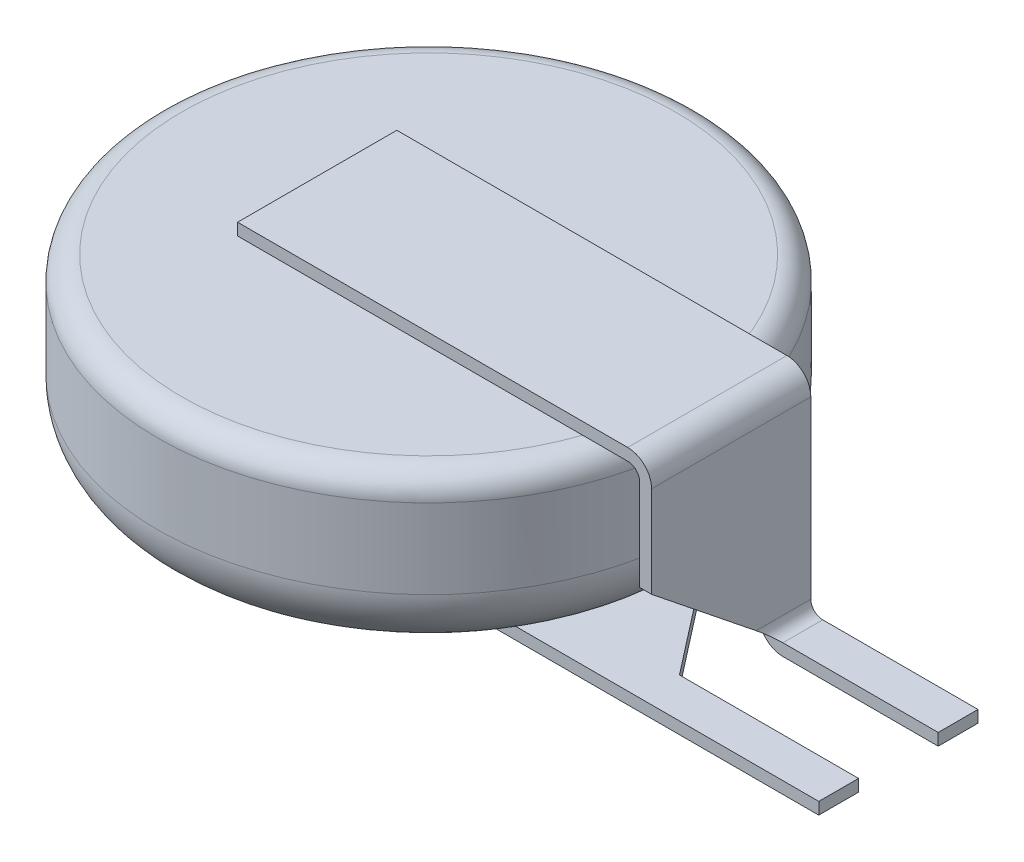
ISO-10303-21;
HEADER;
FILE_DESCRIPTION(('STEP AP214'),'2;1');
FILE_NAME('part.step','',(''),(''),'','','');
FILE_SCHEMA(('AUTOMOTIVE_DESIGN { 1 0 10303 214 1 1 1 1 }'));
ENDSEC;
DATA;
#1=APPLICATION_CONTEXT('core data for automotive mechanical design processes');
#2=APPLICATION_PROTOCOL_DEFINITION('international standard','automotive_design',2000,#1);
#3=PRODUCT_CONTEXT('',#1,'mechanical');
#4=PRODUCT('Part','Part','',(#3));
#5=PRODUCT_RELATED_PRODUCT_CATEGORY('part','',(#4));
#6=PRODUCT_DEFINITION_FORMATION('','',#4);
#7=PRODUCT_DEFINITION_CONTEXT('part definition',#1,'design');
#8=PRODUCT_DEFINITION('design','',#6,#7);
#9=PRODUCT_DEFINITION_SHAPE('','',#8);
#10=(LENGTH_UNIT() NAMED_UNIT(*) SI_UNIT(.MILLI.,.METRE.));
#11=(NAMED_UNIT(*) PLANE_ANGLE_UNIT() SI_UNIT($,.RADIAN.));
#12=(NAMED_UNIT(*) SI_UNIT($,.STERADIAN.) SOLID_ANGLE_UNIT());
#13=UNCERTAINTY_MEASURE_WITH_UNIT(LENGTH_MEASURE(1.E-05),#10,'distance_accuracy_value','');
#14=(GEOMETRIC_REPRESENTATION_CONTEXT(3) GLOBAL_UNCERTAINTY_ASSIGNED_CONTEXT((#13)) GLOBAL_UNIT_ASSIGNED_CONTEXT((#10,
#11,#12)) REPRESENTATION_CONTEXT('',''));
#15=CARTESIAN_POINT('',(0.,0.,0.));
#16=DIRECTION('',(0.,0.,1.));
#17=DIRECTION('',(1.,0.,0.));
#18=AXIS2_PLACEMENT_3D('',#15,#16,#17);
#19=CARTESIAN_POINT('',(-1.79843682124227,0.,1.));
#20=DIRECTION('',(0.,1.,0.));
#21=DIRECTION('',(-1.,0.,0.));
#22=AXIS2_PLACEMENT_3D('',#19,#20,#21);
#23=PLANE('',#22);
#24=DIRECTION('',(1.,0.,0.));
#25=VECTOR('',#24,1.);
#26=CARTESIAN_POINT('',(1.63063936939713,0.,-0.5));
#27=LINE('',#26,#25);
#28=CARTESIAN_POINT('',(3.95,0.,-0.5));
#29=VERTEX_POINT('',#28);
#30=CARTESIAN_POINT('',(5.9,0.,-0.5));
#31=VERTEX_POINT('',#30);
#32=EDGE_CURVE('E708',#29,#31,#27,.T.);
#33=ORIENTED_EDGE('',*,*,#32,.F.);
#34=DIRECTION('',(0.,0.,1.));
#35=VECTOR('',#34,1.);
#36=CARTESIAN_POINT('',(3.95,0.,1.));
#37=LINE('',#36,#35);
#38=CARTESIAN_POINT('',(3.95,0.,-1.));
#39=VERTEX_POINT('',#38);
#40=EDGE_CURVE('E283',#29,#39,#37,.F.);
#41=ORIENTED_EDGE('',*,*,#40,.T.);
#42=DIRECTION('',(1.,0.,0.));
#43=VECTOR('',#42,1.);
#44=CARTESIAN_POINT('',(-1.79843682124227,0.,-1.));
#45=LINE('',#44,#43);
#46=CARTESIAN_POINT('',(5.9,0.,-1.));
#47=VERTEX_POINT('',#46);
#48=EDGE_CURVE('E353',#39,#47,#45,.T.);
#49=ORIENTED_EDGE('',*,*,#48,.T.);
#50=DIRECTION('',(0.,0.,-1.));
#51=VECTOR('',#50,1.);
#52=CARTESIAN_POINT('',(5.9,0.,1.));
#53=LINE('',#52,#51);
#54=EDGE_CURVE('E225',#31,#47,#53,.T.);
#55=ORIENTED_EDGE('',*,*,#54,.F.);
#56=EDGE_LOOP('',(#33,#41,#49,#55));
#57=FACE_BOUND('',#56,.T.);
#58=ADVANCED_FACE('F35',(#57),#23,.F.);
#59=CARTESIAN_POINT('',(0.,0.,-1.));
#60=DIRECTION('',(0.,0.,1.));
#61=DIRECTION('',(1.,0.,0.));
#62=AXIS2_PLACEMENT_3D('',#59,#60,#61);
#63=PLANE('',#62);
#64=ORIENTED_EDGE('',*,*,#48,.F.);
#65=CARTESIAN_POINT('',(3.95,0.3,-1.));
#66=DIRECTION('',(0.,0.,1.));
#67=DIRECTION('',(1.,0.,0.));
#68=AXIS2_PLACEMENT_3D('',#65,#66,#67);
#69=CIRCLE('',#68,0.3);
#70=CARTESIAN_POINT('',(3.65,0.3,-1.));
#71=VERTEX_POINT('',#70);
#72=EDGE_CURVE('E287',#39,#71,#69,.F.);
#73=ORIENTED_EDGE('',*,*,#72,.T.);
#74=DIRECTION('',(0.,-1.,0.));
#75=VECTOR('',#74,1.);
#76=CARTESIAN_POINT('',(3.65,2.65,-1.));
#77=LINE('',#76,#75);
#78=CARTESIAN_POINT('',(3.65,2.5,-1.));
#79=VERTEX_POINT('',#78);
#80=EDGE_CURVE('E209',#79,#71,#77,.T.);
#81=ORIENTED_EDGE('',*,*,#80,.F.);
#82=CARTESIAN_POINT('',(3.5,2.5,-1.));
#83=DIRECTION('',(0.,0.,1.));
#84=DIRECTION('',(1.,0.,0.));
#85=AXIS2_PLACEMENT_3D('',#82,#83,#84);
#86=CIRCLE('',#85,0.15);
#87=CARTESIAN_POINT('',(3.5,2.65,-1.));
#88=VERTEX_POINT('',#87);
#89=EDGE_CURVE('E272',#79,#88,#86,.T.);
#90=ORIENTED_EDGE('',*,*,#89,.T.);
#91=DIRECTION('',(1.,0.,0.));
#92=VECTOR('',#91,1.);
#93=CARTESIAN_POINT('',(-1.4,2.65,-1.));
#94=LINE('',#93,#92);
#95=CARTESIAN_POINT('',(2.93428015022357,2.65,-1.));
#96=VERTEX_POINT('',#95);
#97=EDGE_CURVE('E309',#96,#88,#94,.T.);
#98=ORIENTED_EDGE('',*,*,#97,.F.);
#99=CARTESIAN_POINT('',(-1.4,2.65,-1.));
#100=VERTEX_POINT('',#99);
#101=EDGE_CURVE('E314',#100,#96,#94,.T.);
#102=ORIENTED_EDGE('',*,*,#101,.F.);
#103=DIRECTION('',(0.,-1.,0.));
#104=VECTOR('',#103,1.);
#105=CARTESIAN_POINT('',(-1.4,2.65,-1.));
#106=LINE('',#105,#104);
#107=CARTESIAN_POINT('',(-1.4,2.8,-1.));
#108=VERTEX_POINT('',#107);
#109=EDGE_CURVE('E306',#108,#100,#106,.T.);
#110=ORIENTED_EDGE('',*,*,#109,.F.);
#111=DIRECTION('',(-1.,0.,0.));
#112=VECTOR('',#111,1.);
#113=CARTESIAN_POINT('',(-1.4,2.8,-1.));
#114=LINE('',#113,#112);
#115=CARTESIAN_POINT('',(3.5,2.8,-1.));
#116=VERTEX_POINT('',#115);
#117=EDGE_CURVE('E296',#116,#108,#114,.T.);
#118=ORIENTED_EDGE('',*,*,#117,.F.);
#119=CARTESIAN_POINT('',(3.5,2.5,-1.));
#120=DIRECTION('',(0.,0.,1.));
#121=DIRECTION('',(1.,0.,0.));
#122=AXIS2_PLACEMENT_3D('',#119,#120,#121);
#123=CIRCLE('',#122,0.3);
#124=CARTESIAN_POINT('',(3.8,2.5,-1.));
#125=VERTEX_POINT('',#124);
#126=EDGE_CURVE('E285',#116,#125,#123,.F.);
#127=ORIENTED_EDGE('',*,*,#126,.T.);
#128=DIRECTION('',(0.,1.,0.));
#129=VECTOR('',#128,1.);
#130=CARTESIAN_POINT('',(3.8,2.8,-1.));
#131=LINE('',#130,#129);
#132=CARTESIAN_POINT('',(3.8,0.3,-1.));
#133=VERTEX_POINT('',#132);
#134=EDGE_CURVE('E307',#133,#125,#131,.T.);
#135=ORIENTED_EDGE('',*,*,#134,.F.);
#136=CARTESIAN_POINT('',(3.95,0.3,-1.));
#137=DIRECTION('',(0.,0.,1.));
#138=DIRECTION('',(1.,0.,0.));
#139=AXIS2_PLACEMENT_3D('',#136,#137,#138);
#140=CIRCLE('',#139,0.15);
#141=CARTESIAN_POINT('',(3.95,0.15,-1.));
#142=VERTEX_POINT('',#141);
#143=EDGE_CURVE('E268',#133,#142,#140,.T.);
#144=ORIENTED_EDGE('',*,*,#143,.T.);
#145=DIRECTION('',(-1.,0.,0.));
#146=VECTOR('',#145,1.);
#147=CARTESIAN_POINT('',(3.8,0.15,-1.));
#148=LINE('',#147,#146);
#149=CARTESIAN_POINT('',(5.9,0.15,-1.));
#150=VERTEX_POINT('',#149);
#151=EDGE_CURVE('E311',#150,#142,#148,.T.);
#152=ORIENTED_EDGE('',*,*,#151,.F.);
#153=DIRECTION('',(0.,1.,0.));
#154=VECTOR('',#153,1.);
#155=CARTESIAN_POINT('',(5.9,0.15,-1.));
#156=LINE('',#155,#154);
#157=EDGE_CURVE('E357',#47,#150,#156,.T.);
#158=ORIENTED_EDGE('',*,*,#157,.F.);
#159=EDGE_LOOP('',(#64,#73,#81,#90,#98,#102,#110,#118,#127,#135,#144,#152,#158));
#160=FACE_BOUND('',#159,.T.);
#161=ADVANCED_FACE('F302',(#160),#63,.F.);
#162=CARTESIAN_POINT('',(5.9,0.15,1.));
#163=DIRECTION('',(-1.,0.,0.));
#164=DIRECTION('',(0.,-1.,0.));
#165=AXIS2_PLACEMENT_3D('',#162,#163,#164);
#166=PLANE('',#165);
#167=DIRECTION('',(0.,0.,-1.));
#168=VECTOR('',#167,1.);
#169=CARTESIAN_POINT('',(5.9,0.15,1.));
#170=LINE('',#169,#168);
#171=CARTESIAN_POINT('',(5.9,0.15,-0.5));
#172=VERTEX_POINT('',#171);
#173=EDGE_CURVE('E222',#172,#150,#170,.T.);
#174=ORIENTED_EDGE('',*,*,#173,.F.);
#175=DIRECTION('',(0.,1.,0.));
#176=VECTOR('',#175,1.);
#177=CARTESIAN_POINT('',(5.9,0.15,-0.5));
#178=LINE('',#177,#176);
#179=EDGE_CURVE('E703',#31,#172,#178,.T.);
#180=ORIENTED_EDGE('',*,*,#179,.F.);
#181=ORIENTED_EDGE('',*,*,#54,.T.);
#182=ORIENTED_EDGE('',*,*,#157,.T.);
#183=EDGE_LOOP('',(#174,#180,#181,#182));
#184=FACE_BOUND('',#183,.T.);
#185=ADVANCED_FACE('F423',(#184),#166,.F.);
#186=CARTESIAN_POINT('',(3.8,0.15,1.));
#187=DIRECTION('',(0.,-1.,0.));
#188=DIRECTION('',(1.,0.,0.));
#189=AXIS2_PLACEMENT_3D('',#186,#187,#188);
#190=PLANE('',#189);
#191=ORIENTED_EDGE('',*,*,#151,.T.);
#192=DIRECTION('',(0.,0.,-1.));
#193=VECTOR('',#192,1.);
#194=CARTESIAN_POINT('',(3.95,0.15,-0.5));
#195=LINE('',#194,#193);
#196=CARTESIAN_POINT('',(3.95,0.149999999999989,-0.5));
#197=VERTEX_POINT('',#196);
#198=EDGE_CURVE('E260',#142,#197,#195,.F.);
#199=ORIENTED_EDGE('',*,*,#198,.T.);
#200=DIRECTION('',(1.,0.,0.));
#201=VECTOR('',#200,1.);
#202=CARTESIAN_POINT('',(1.63063936939713,0.149999999999975,-0.5));
#203=LINE('',#202,#201);
#204=EDGE_CURVE('E707',#197,#172,#203,.T.);
#205=ORIENTED_EDGE('',*,*,#204,.T.);
#206=ORIENTED_EDGE('',*,*,#173,.T.);
#207=EDGE_LOOP('',(#191,#199,#205,#206));
#208=FACE_BOUND('',#207,.T.);
#209=ADVANCED_FACE('F363',(#208),#190,.F.);
#210=CARTESIAN_POINT('',(0.,0.,1.));
#211=DIRECTION('',(0.,0.,1.));
#212=DIRECTION('',(1.,0.,0.));
#213=AXIS2_PLACEMENT_3D('',#210,#211,#212);
#214=PLANE('',#213);
#215=DIRECTION('',(0.,1.,0.));
#216=VECTOR('',#215,1.);
#217=CARTESIAN_POINT('',(3.8,2.8,1.));
#218=LINE('',#217,#216);
#219=CARTESIAN_POINT('',(3.8,1.35196795687946,1.));
#220=VERTEX_POINT('',#219);
#221=CARTESIAN_POINT('',(3.8,2.5,1.));
#222=VERTEX_POINT('',#221);
#223=EDGE_CURVE('E377',#220,#222,#218,.T.);
#224=ORIENTED_EDGE('',*,*,#223,.T.);
#225=CARTESIAN_POINT('',(3.5,2.5,1.));
#226=DIRECTION('',(0.,0.,1.));
#227=DIRECTION('',(1.,0.,0.));
#228=AXIS2_PLACEMENT_3D('',#225,#226,#227);
#229=CIRCLE('',#228,0.3);
#230=CARTESIAN_POINT('',(3.5,2.8,1.));
#231=VERTEX_POINT('',#230);
#232=EDGE_CURVE('E11',#222,#231,#229,.T.);
#233=ORIENTED_EDGE('',*,*,#232,.T.);
#234=DIRECTION('',(-1.,0.,0.));
#235=VECTOR('',#234,1.);
#236=CARTESIAN_POINT('',(-1.4,2.8,1.));
#237=LINE('',#236,#235);
#238=CARTESIAN_POINT('',(-1.4,2.8,1.));
#239=VERTEX_POINT('',#238);
#240=EDGE_CURVE('E297',#231,#239,#237,.T.);
#241=ORIENTED_EDGE('',*,*,#240,.T.);
#242=DIRECTION('',(0.,-1.,0.));
#243=VECTOR('',#242,1.);
#244=CARTESIAN_POINT('',(-1.4,2.65,1.));
#245=LINE('',#244,#243);
#246=CARTESIAN_POINT('',(-1.4,2.65,1.));
#247=VERTEX_POINT('',#246);
#248=EDGE_CURVE('E390',#239,#247,#245,.T.);
#249=ORIENTED_EDGE('',*,*,#248,.T.);
#250=DIRECTION('',(1.,0.,0.));
#251=VECTOR('',#250,1.);
#252=CARTESIAN_POINT('',(-1.4,2.65,1.));
#253=LINE('',#252,#251);
#254=CARTESIAN_POINT('',(2.93428015022424,2.65,1.));
#255=VERTEX_POINT('',#254);
#256=EDGE_CURVE('E343',#247,#255,#253,.T.);
#257=ORIENTED_EDGE('',*,*,#256,.T.);
#258=CARTESIAN_POINT('',(3.5,2.65,1.));
#259=VERTEX_POINT('',#258);
#260=EDGE_CURVE('E336',#255,#259,#253,.T.);
#261=ORIENTED_EDGE('',*,*,#260,.T.);
#262=CARTESIAN_POINT('',(3.5,2.5,1.));
#263=DIRECTION('',(0.,0.,1.));
#264=DIRECTION('',(1.,0.,0.));
#265=AXIS2_PLACEMENT_3D('',#262,#263,#264);
#266=CIRCLE('',#265,0.15);
#267=CARTESIAN_POINT('',(3.65,2.5,1.));
#268=VERTEX_POINT('',#267);
#269=EDGE_CURVE('E274',#259,#268,#266,.F.);
#270=ORIENTED_EDGE('',*,*,#269,.T.);
#271=DIRECTION('',(0.,-1.,0.));
#272=VECTOR('',#271,1.);
#273=CARTESIAN_POINT('',(3.65,2.65,1.));
#274=LINE('',#273,#272);
#275=CARTESIAN_POINT('',(3.65,1.35196795687946,1.));
#276=VERTEX_POINT('',#275);
#277=EDGE_CURVE('E333',#268,#276,#274,.T.);
#278=ORIENTED_EDGE('',*,*,#277,.T.);
#279=DIRECTION('',(1.,0.,0.));
#280=VECTOR('',#279,1.);
#281=CARTESIAN_POINT('',(1.63063936939712,1.35196795687945,1.));
#282=LINE('',#281,#280);
#283=EDGE_CURVE('E697',#276,#220,#282,.T.);
#284=ORIENTED_EDGE('',*,*,#283,.T.);
#285=EDGE_LOOP('',(#224,#233,#241,#249,#257,#261,#270,#278,#284));
#286=FACE_BOUND('',#285,.T.);
#287=ADVANCED_FACE('F331',(#286),#214,.T.);
#288=CARTESIAN_POINT('',(0.,2.65,0.));
#289=DIRECTION('',(0.,-1.,0.));
#290=DIRECTION('',(1.,0.,0.));
#291=AXIS2_PLACEMENT_3D('',#288,#289,#290);
#292=PLANE('',#291);
#293=CARTESIAN_POINT('',(0.,2.65,0.));
#294=DIRECTION('',(0.,-1.,0.));
#295=DIRECTION('',(1.,0.,0.));
#296=AXIS2_PLACEMENT_3D('',#293,#294,#295);
#297=CIRCLE('',#296,3.1);
#298=EDGE_CURVE('E242',#96,#255,#297,.F.);
#299=ORIENTED_EDGE('',*,*,#298,.T.);
#300=ORIENTED_EDGE('',*,*,#256,.F.);
#301=DIRECTION('',(0.,0.,-1.));
#302=VECTOR('',#301,1.);
#303=CARTESIAN_POINT('',(-1.4,2.65,1.));
#304=LINE('',#303,#302);
#305=EDGE_CURVE('E216',#247,#100,#304,.T.);
#306=ORIENTED_EDGE('',*,*,#305,.T.);
#307=ORIENTED_EDGE('',*,*,#101,.T.);
#308=EDGE_LOOP('',(#299,#300,#306,#307));
#309=FACE_BOUND('',#308,.T.);
#310=ADVANCED_FACE('F396',(#309),#292,.F.);
#311=CARTESIAN_POINT('',(0.,2.65,0.));
#312=DIRECTION('',(0.,1.,0.));
#313=DIRECTION('',(-1.,0.,0.));
#314=AXIS2_PLACEMENT_3D('',#311,#312,#313);
#315=CYLINDRICAL_SURFACE('',#314,3.4);
#316=CARTESIAN_POINT('',(0.,1.35196795687944,0.));
#317=DIRECTION('',(0.,1.,0.));
#318=DIRECTION('',(-1.,0.,0.));
#319=AXIS2_PLACEMENT_3D('',#316,#317,#318);
#320=CIRCLE('',#319,3.4);
#321=CARTESIAN_POINT('',(-3.4,1.35196795687944,0.));
#322=VERTEX_POINT('',#321);
#323=EDGE_CURVE('E248',#322,#322,#320,.T.);
#324=ORIENTED_EDGE('',*,*,#323,.T.);
#325=EDGE_LOOP('',(#324));
#326=FACE_BOUND('',#325,.T.);
#327=CARTESIAN_POINT('',(0.,2.35,0.));
#328=DIRECTION('',(0.,-1.,0.));
#329=DIRECTION('',(1.,0.,0.));
#330=AXIS2_PLACEMENT_3D('',#327,#328,#329);
#331=CIRCLE('',#330,3.4);
#332=CARTESIAN_POINT('',(3.4,2.35,0.));
#333=VERTEX_POINT('',#332);
#334=EDGE_CURVE('E245',#333,#333,#331,.T.);
#335=ORIENTED_EDGE('',*,*,#334,.T.);
#336=EDGE_LOOP('',(#335));
#337=FACE_BOUND('',#336,.T.);
#338=ADVANCED_FACE('F469',(#326,#337),#315,.T.);
#339=CARTESIAN_POINT('',(0.,0.412581371965646,0.));
#340=DIRECTION('',(0.,1.,0.));
#341=DIRECTION('',(-1.,0.,0.));
#342=AXIS2_PLACEMENT_3D('',#339,#340,#341);
#343=CONICAL_SURFACE('',#342,2.50541624595136,0.596199141297475);
#344=CARTESIAN_POINT('',(0.,0.551967956879436,0.));
#345=DIRECTION('',(0.,1.,0.));
#346=DIRECTION('',(-1.,0.,0.));
#347=AXIS2_PLACEMENT_3D('',#344,#345,#346);
#348=CIRCLE('',#347,2.6);
#349=CARTESIAN_POINT('',(-2.6,0.551967956879436,0.));
#350=VERTEX_POINT('',#349);
#351=EDGE_CURVE('E238',#350,#350,#348,.T.);
#352=ORIENTED_EDGE('',*,*,#351,.F.);
#353=EDGE_LOOP('',(#352));
#354=FACE_BOUND('',#353,.T.);
#355=CARTESIAN_POINT('',(0.,0.412581371965646,0.));
#356=DIRECTION('',(0.,1.,0.));
#357=DIRECTION('',(-1.,0.,0.));
#358=AXIS2_PLACEMENT_3D('',#355,#356,#357);
#359=CIRCLE('',#358,2.50541624595136);
#360=CARTESIAN_POINT('',(-2.50541624595136,0.412581371965646,0.));
#361=VERTEX_POINT('',#360);
#362=EDGE_CURVE('E235',#361,#361,#359,.T.);
#363=ORIENTED_EDGE('',*,*,#362,.T.);
#364=EDGE_LOOP('',(#363));
#365=FACE_BOUND('',#364,.T.);
#366=ADVANCED_FACE('F463',(#354,#365),#343,.T.);
#367=CARTESIAN_POINT('',(2.50541624595136,0.412581371965646,0.));
#368=DIRECTION('',(0.,1.,0.));
#369=DIRECTION('',(-1.,0.,0.));
#370=AXIS2_PLACEMENT_3D('',#367,#368,#369);
#371=PLANE('',#370);
#372=ORIENTED_EDGE('',*,*,#362,.F.);
#373=EDGE_LOOP('',(#372));
#374=FACE_BOUND('',#373,.T.);
#375=CARTESIAN_POINT('',(0.,0.412581371965646,0.));
#376=DIRECTION('',(0.,1.,0.));
#377=DIRECTION('',(-1.,0.,0.));
#378=AXIS2_PLACEMENT_3D('',#375,#376,#377);
#379=CIRCLE('',#378,2.37011754704505);
#380=CARTESIAN_POINT('',(-2.37011754704505,0.412581371965646,0.));
#381=VERTEX_POINT('',#380);
#382=EDGE_CURVE('E232',#381,#381,#379,.T.);
#383=ORIENTED_EDGE('',*,*,#382,.T.);
#384=EDGE_LOOP('',(#383));
#385=FACE_BOUND('',#384,.T.);
#386=ADVANCED_FACE('F458',(#374,#385),#371,.F.);
#387=CARTESIAN_POINT('',(0.,0.15,0.));
#388=DIRECTION('',(0.,1.,0.));
#389=DIRECTION('',(-1.,0.,0.));
#390=AXIS2_PLACEMENT_3D('',#387,#388,#389);
#391=CONICAL_SURFACE('',#390,2.19193733035407,0.596199141297474);
#392=CARTESIAN_POINT('',(0.,0.237699716332548,0.));
#393=DIRECTION('',(0.,-1.,0.));
#394=DIRECTION('',(1.,0.,0.));
#395=AXIS2_PLACEMENT_3D('',#392,#393,#394);
#396=CIRCLE('',#395,2.25144785215116);
#397=CARTESIAN_POINT('',(2.25144785215116,0.237699716332548,0.));
#398=VERTEX_POINT('',#397);
#399=EDGE_CURVE('E251',#398,#398,#396,.F.);
#400=ORIENTED_EDGE('',*,*,#399,.T.);
#401=EDGE_LOOP('',(#400));
#402=FACE_BOUND('',#401,.T.);
#403=ORIENTED_EDGE('',*,*,#382,.F.);
#404=EDGE_LOOP('',(#403));
#405=FACE_BOUND('',#404,.T.);
#406=ADVANCED_FACE('F411',(#402,#405),#391,.T.);
#407=CARTESIAN_POINT('',(2.19193733035407,0.15,0.));
#408=DIRECTION('',(0.,1.,0.));
#409=DIRECTION('',(-1.,0.,0.));
#410=AXIS2_PLACEMENT_3D('',#407,#408,#409);
#411=PLANE('',#410);
#412=DIRECTION('',(0.,0.,-1.));
#413=VECTOR('',#412,1.);
#414=CARTESIAN_POINT('',(-1.79843682124227,0.15,1.));
#415=LINE('',#414,#413);
#416=CARTESIAN_POINT('',(-1.79843682124227,0.15,1.));
#417=VERTEX_POINT('',#416);
#418=CARTESIAN_POINT('',(-1.79843682124227,0.15,-1.));
#419=VERTEX_POINT('',#418);
#420=EDGE_CURVE('E213',#417,#419,#415,.T.);
#421=ORIENTED_EDGE('',*,*,#420,.F.);
#422=DIRECTION('',(-1.,0.,0.));
#423=VECTOR('',#422,1.);
#424=CARTESIAN_POINT('',(-1.79843682124227,0.15,1.));
#425=LINE('',#424,#423);
#426=CARTESIAN_POINT('',(1.8306279401505,0.15,1.));
#427=VERTEX_POINT('',#426);
#428=EDGE_CURVE('E217',#427,#417,#425,.T.);
#429=ORIENTED_EDGE('',*,*,#428,.F.);
#430=CARTESIAN_POINT('',(0.,0.15,0.));
#431=DIRECTION('',(0.,1.,0.));
#432=DIRECTION('',(-1.,0.,0.));
#433=AXIS2_PLACEMENT_3D('',#430,#431,#432);
#434=CIRCLE('',#433,2.08595269727281);
#435=CARTESIAN_POINT('',(1.83062794015051,0.15,-1.));
#436=VERTEX_POINT('',#435);
#437=EDGE_CURVE('E254',#427,#436,#434,.F.);
#438=ORIENTED_EDGE('',*,*,#437,.T.);
#439=DIRECTION('',(-1.,0.,0.));
#440=VECTOR('',#439,1.);
#441=CARTESIAN_POINT('',(-1.79843682124227,0.15,-1.));
#442=LINE('',#441,#440);
#443=EDGE_CURVE('E203',#436,#419,#442,.T.);
#444=ORIENTED_EDGE('',*,*,#443,.T.);
#445=EDGE_LOOP('',(#421,#429,#438,#444));
#446=FACE_BOUND('',#445,.T.);
#447=ADVANCED_FACE('F401',(#446),#411,.F.);
#448=CARTESIAN_POINT('',(0.,2.35,0.));
#449=DIRECTION('',(0.,-1.,0.));
#450=DIRECTION('',(1.,0.,0.));
#451=AXIS2_PLACEMENT_3D('',#448,#449,#450);
#452=TOROIDAL_SURFACE('',#451,3.1,0.3);
#453=ORIENTED_EDGE('',*,*,#334,.F.);
#454=EDGE_LOOP('',(#453));
#455=FACE_BOUND('',#454,.T.);
#456=ORIENTED_EDGE('',*,*,#298,.F.);
#457=EDGE_CURVE('E241',#255,#96,#297,.F.);
#458=ORIENTED_EDGE('',*,*,#457,.F.);
#459=EDGE_LOOP('',(#456,#458));
#460=FACE_BOUND('',#459,.T.);
#461=ADVANCED_FACE('F398',(#455,#460),#452,.T.);
#462=CARTESIAN_POINT('',(0.,1.35196795687944,0.));
#463=DIRECTION('',(0.,1.,0.));
#464=DIRECTION('',(-1.,0.,0.));
#465=AXIS2_PLACEMENT_3D('',#462,#463,#464);
#466=TOROIDAL_SURFACE('',#465,2.6,0.8);
#467=ORIENTED_EDGE('',*,*,#351,.T.);
#468=EDGE_LOOP('',(#467));
#469=FACE_BOUND('',#468,.T.);
#470=ORIENTED_EDGE('',*,*,#323,.F.);
#471=EDGE_LOOP('',(#470));
#472=FACE_BOUND('',#471,.T.);
#473=ADVANCED_FACE('F400',(#469,#472),#466,.T.);
#474=CARTESIAN_POINT('',(0.,0.35,0.));
#475=DIRECTION('',(0.,1.,0.));
#476=DIRECTION('',(-1.,0.,0.));
#477=AXIS2_PLACEMENT_3D('',#474,#475,#476);
#478=TOROIDAL_SURFACE('',#477,2.08595269727281,0.2);
#479=EDGE_CURVE('E255',#436,#427,#434,.F.);
#480=ORIENTED_EDGE('',*,*,#479,.F.);
#481=ORIENTED_EDGE('',*,*,#437,.F.);
#482=EDGE_LOOP('',(#480,#481));
#483=FACE_BOUND('',#482,.T.);
#484=ORIENTED_EDGE('',*,*,#399,.F.);
#485=EDGE_LOOP('',(#484));
#486=FACE_BOUND('',#485,.T.);
#487=ADVANCED_FACE('F408',(#483,#486),#478,.T.);
#488=CARTESIAN_POINT('',(-1.79843682124227,0.15,1.));
#489=DIRECTION('',(1.,0.,0.));
#490=DIRECTION('',(0.,0.,-1.));
#491=AXIS2_PLACEMENT_3D('',#488,#489,#490);
#492=PLANE('',#491);
#493=DIRECTION('',(0.,-1.,0.));
#494=VECTOR('',#493,1.);
#495=CARTESIAN_POINT('',(-1.79843682124227,0.15,-1.));
#496=LINE('',#495,#494);
#497=CARTESIAN_POINT('',(-1.79843682124227,0.,-1.));
#498=VERTEX_POINT('',#497);
#499=EDGE_CURVE('E350',#419,#498,#496,.T.);
#500=ORIENTED_EDGE('',*,*,#499,.T.);
#501=DIRECTION('',(0.,0.,-1.));
#502=VECTOR('',#501,1.);
#503=CARTESIAN_POINT('',(-1.79843682124227,0.,1.));
#504=LINE('',#503,#502);
#505=CARTESIAN_POINT('',(-1.79843682124227,0.,1.));
#506=VERTEX_POINT('',#505);
#507=EDGE_CURVE('E229',#506,#498,#504,.T.);
#508=ORIENTED_EDGE('',*,*,#507,.F.);
#509=DIRECTION('',(0.,-1.,0.));
#510=VECTOR('',#509,1.);
#511=CARTESIAN_POINT('',(-1.79843682124227,0.15,1.));
#512=LINE('',#511,#510);
#513=EDGE_CURVE('E204',#417,#506,#512,.T.);
#514=ORIENTED_EDGE('',*,*,#513,.F.);
#515=ORIENTED_EDGE('',*,*,#420,.T.);
#516=EDGE_LOOP('',(#500,#508,#514,#515));
#517=FACE_BOUND('',#516,.T.);
#518=ADVANCED_FACE('F430',(#517),#492,.F.);
#519=CARTESIAN_POINT('',(2.48451244788087,0.,-1.));
#520=VERTEX_POINT('',#519);
#521=EDGE_CURVE('E355',#498,#520,#45,.T.);
#522=ORIENTED_EDGE('',*,*,#521,.T.);
#523=DIRECTION('',(-0.613553778832495,0.,-0.789652936726234));
#524=VECTOR('',#523,1.);
#525=CARTESIAN_POINT('',(3.65,0.,0.5));
#526=LINE('',#525,#524);
#527=CARTESIAN_POINT('',(3.65,0.,0.5));
#528=VERTEX_POINT('',#527);
#529=EDGE_CURVE('E185',#528,#520,#526,.T.);
#530=ORIENTED_EDGE('',*,*,#529,.F.);
#531=DIRECTION('',(1.,0.,0.));
#532=VECTOR('',#531,1.);
#533=CARTESIAN_POINT('',(1.63063936939713,0.,0.5));
#534=LINE('',#533,#532);
#535=CARTESIAN_POINT('',(5.9,0.,0.5));
#536=VERTEX_POINT('',#535);
#537=EDGE_CURVE('E696',#528,#536,#534,.T.);
#538=ORIENTED_EDGE('',*,*,#537,.T.);
#539=CARTESIAN_POINT('',(5.9,0.,1.));
#540=VERTEX_POINT('',#539);
#541=EDGE_CURVE('E226',#540,#536,#53,.T.);
#542=ORIENTED_EDGE('',*,*,#541,.F.);
#543=DIRECTION('',(1.,0.,0.));
#544=VECTOR('',#543,1.);
#545=CARTESIAN_POINT('',(-1.79843682124227,0.,1.));
#546=LINE('',#545,#544);
#547=EDGE_CURVE('E207',#506,#540,#546,.T.);
#548=ORIENTED_EDGE('',*,*,#547,.F.);
#549=ORIENTED_EDGE('',*,*,#507,.T.);
#550=EDGE_LOOP('',(#522,#530,#538,#542,#548,#549));
#551=FACE_BOUND('',#550,.T.);
#552=ADVANCED_FACE('F419',(#551),#23,.F.);
#553=ORIENTED_EDGE('',*,*,#541,.T.);
#554=DIRECTION('',(0.,-1.,0.));
#555=VECTOR('',#554,1.);
#556=CARTESIAN_POINT('',(5.9,0.,0.5));
#557=LINE('',#556,#555);
#558=CARTESIAN_POINT('',(5.9,0.15,0.5));
#559=VERTEX_POINT('',#558);
#560=EDGE_CURVE('E189',#559,#536,#557,.T.);
#561=ORIENTED_EDGE('',*,*,#560,.F.);
#562=CARTESIAN_POINT('',(5.9,0.15,1.));
#563=VERTEX_POINT('',#562);
#564=EDGE_CURVE('E223',#563,#559,#170,.T.);
#565=ORIENTED_EDGE('',*,*,#564,.F.);
#566=DIRECTION('',(0.,1.,0.));
#567=VECTOR('',#566,1.);
#568=CARTESIAN_POINT('',(5.9,0.15,1.));
#569=LINE('',#568,#567);
#570=EDGE_CURVE('E385',#540,#563,#569,.T.);
#571=ORIENTED_EDGE('',*,*,#570,.F.);
#572=EDGE_LOOP('',(#553,#561,#565,#571));
#573=FACE_BOUND('',#572,.T.);
#574=ADVANCED_FACE('F429',(#573),#166,.F.);
#575=DIRECTION('',(1.,0.,0.));
#576=VECTOR('',#575,1.);
#577=CARTESIAN_POINT('',(1.63063936939713,0.149999999999975,0.5));
#578=LINE('',#577,#576);
#579=CARTESIAN_POINT('',(3.65,0.149999999999987,0.5));
#580=VERTEX_POINT('',#579);
#581=EDGE_CURVE('E198',#580,#559,#578,.T.);
#582=ORIENTED_EDGE('',*,*,#581,.F.);
#583=DIRECTION('',(-0.613553778832495,0.,-0.789652936726234));
#584=VECTOR('',#583,1.);
#585=CARTESIAN_POINT('',(3.65,0.15,0.5));
#586=LINE('',#585,#584);
#587=CARTESIAN_POINT('',(2.48451244788087,0.15,-1.));
#588=VERTEX_POINT('',#587);
#589=EDGE_CURVE('E182',#580,#588,#586,.T.);
#590=ORIENTED_EDGE('',*,*,#589,.T.);
#591=EDGE_CURVE('E195',#588,#436,#442,.T.);
#592=ORIENTED_EDGE('',*,*,#591,.T.);
#593=ORIENTED_EDGE('',*,*,#479,.T.);
#594=DIRECTION('',(-1.,0.,0.));
#595=VECTOR('',#594,1.);
#596=CARTESIAN_POINT('',(3.8,0.15,1.));
#597=LINE('',#596,#595);
#598=EDGE_CURVE('E387',#563,#427,#597,.T.);
#599=ORIENTED_EDGE('',*,*,#598,.F.);
#600=ORIENTED_EDGE('',*,*,#564,.T.);
#601=EDGE_LOOP('',(#582,#590,#592,#593,#599,#600));
#602=FACE_BOUND('',#601,.T.);
#603=ADVANCED_FACE('F193',(#602),#190,.F.);
#604=CARTESIAN_POINT('',(3.8,2.8,1.));
#605=DIRECTION('',(-1.,0.,0.));
#606=DIRECTION('',(0.,-1.,0.));
#607=AXIS2_PLACEMENT_3D('',#604,#605,#606);
#608=PLANE('',#607);
#609=ORIENTED_EDGE('',*,*,#134,.T.);
#610=DIRECTION('',(0.,0.,-1.));
#611=VECTOR('',#610,1.);
#612=CARTESIAN_POINT('',(3.8,2.5,1.));
#613=LINE('',#612,#611);
#614=EDGE_CURVE('E43',#125,#222,#613,.F.);
#615=ORIENTED_EDGE('',*,*,#614,.T.);
#616=ORIENTED_EDGE('',*,*,#223,.F.);
#617=DIRECTION('',(0.,-0.625319129545318,-0.780369134592525));
#618=VECTOR('',#617,1.);
#619=CARTESIAN_POINT('',(3.8,1.91818325845572,1.70661031145073));
#620=LINE('',#619,#618);
#621=CARTESIAN_POINT('',(3.8,0.299999999999999,-0.312806989810145));
#622=VERTEX_POINT('',#621);
#623=EDGE_CURVE('E354',#220,#622,#620,.T.);
#624=ORIENTED_EDGE('',*,*,#623,.T.);
#625=DIRECTION('',(0.,0.,-1.));
#626=VECTOR('',#625,1.);
#627=CARTESIAN_POINT('',(3.8,0.3,-1.));
#628=LINE('',#627,#626);
#629=EDGE_CURVE('E257',#622,#133,#628,.T.);
#630=ORIENTED_EDGE('',*,*,#629,.T.);
#631=EDGE_LOOP('',(#609,#615,#616,#624,#630));
#632=FACE_BOUND('',#631,.T.);
#633=ADVANCED_FACE('F376',(#632),#608,.F.);
#634=CARTESIAN_POINT('',(-1.4,2.8,1.));
#635=DIRECTION('',(0.,-1.,0.));
#636=DIRECTION('',(0.,0.,-1.));
#637=AXIS2_PLACEMENT_3D('',#634,#635,#636);
#638=PLANE('',#637);
#639=ORIENTED_EDGE('',*,*,#240,.F.);
#640=DIRECTION('',(0.,0.,-1.));
#641=VECTOR('',#640,1.);
#642=CARTESIAN_POINT('',(3.5,2.8,1.));
#643=LINE('',#642,#641);
#644=EDGE_CURVE('E289',#231,#116,#643,.T.);
#645=ORIENTED_EDGE('',*,*,#644,.T.);
#646=ORIENTED_EDGE('',*,*,#117,.T.);
#647=DIRECTION('',(0.,0.,-1.));
#648=VECTOR('',#647,1.);
#649=CARTESIAN_POINT('',(-1.4,2.8,1.));
#650=LINE('',#649,#648);
#651=EDGE_CURVE('E219',#239,#108,#650,.T.);
#652=ORIENTED_EDGE('',*,*,#651,.F.);
#653=EDGE_LOOP('',(#639,#645,#646,#652));
#654=FACE_BOUND('',#653,.T.);
#655=ADVANCED_FACE('F294',(#654),#638,.F.);
#656=CARTESIAN_POINT('',(-1.4,2.65,1.));
#657=DIRECTION('',(1.,0.,0.));
#658=DIRECTION('',(0.,1.,0.));
#659=AXIS2_PLACEMENT_3D('',#656,#657,#658);
#660=PLANE('',#659);
#661=ORIENTED_EDGE('',*,*,#109,.T.);
#662=ORIENTED_EDGE('',*,*,#305,.F.);
#663=ORIENTED_EDGE('',*,*,#248,.F.);
#664=ORIENTED_EDGE('',*,*,#651,.T.);
#665=EDGE_LOOP('',(#661,#662,#663,#664));
#666=FACE_BOUND('',#665,.T.);
#667=ADVANCED_FACE('F395',(#666),#660,.F.);
#668=CARTESIAN_POINT('',(-1.4,2.65,1.));
#669=DIRECTION('',(0.,1.,0.));
#670=DIRECTION('',(0.,0.,1.));
#671=AXIS2_PLACEMENT_3D('',#668,#669,#670);
#672=PLANE('',#671);
#673=ORIENTED_EDGE('',*,*,#97,.T.);
#674=DIRECTION('',(0.,0.,-1.));
#675=VECTOR('',#674,1.);
#676=CARTESIAN_POINT('',(3.5,2.65,1.));
#677=LINE('',#676,#675);
#678=EDGE_CURVE('E266',#88,#259,#677,.F.);
#679=ORIENTED_EDGE('',*,*,#678,.T.);
#680=ORIENTED_EDGE('',*,*,#260,.F.);
#681=ORIENTED_EDGE('',*,*,#457,.T.);
#682=EDGE_LOOP('',(#673,#679,#680,#681));
#683=FACE_BOUND('',#682,.T.);
#684=ADVANCED_FACE('F323',(#683),#672,.F.);
#685=CARTESIAN_POINT('',(3.65,2.65,1.));
#686=DIRECTION('',(1.,0.,0.));
#687=DIRECTION('',(0.,1.,0.));
#688=AXIS2_PLACEMENT_3D('',#685,#686,#687);
#689=PLANE('',#688);
#690=ORIENTED_EDGE('',*,*,#80,.T.);
#691=DIRECTION('',(0.,0.,1.));
#692=VECTOR('',#691,1.);
#693=CARTESIAN_POINT('',(3.65,0.3,1.));
#694=LINE('',#693,#692);
#695=CARTESIAN_POINT('',(3.65,0.3,-0.312806989810143));
#696=VERTEX_POINT('',#695);
#697=EDGE_CURVE('E276',#71,#696,#694,.T.);
#698=ORIENTED_EDGE('',*,*,#697,.T.);
#699=DIRECTION('',(0.,-0.625319129545318,-0.780369134592525));
#700=VECTOR('',#699,1.);
#701=CARTESIAN_POINT('',(3.65,1.35196795687945,0.999999999999995));
#702=LINE('',#701,#700);
#703=EDGE_CURVE('E342',#276,#696,#702,.T.);
#704=ORIENTED_EDGE('',*,*,#703,.F.);
#705=ORIENTED_EDGE('',*,*,#277,.F.);
#706=DIRECTION('',(0.,0.,-1.));
#707=VECTOR('',#706,1.);
#708=CARTESIAN_POINT('',(3.65,2.5,-1.));
#709=LINE('',#708,#707);
#710=EDGE_CURVE('E263',#268,#79,#709,.T.);
#711=ORIENTED_EDGE('',*,*,#710,.T.);
#712=EDGE_LOOP('',(#690,#698,#704,#705,#711));
#713=FACE_BOUND('',#712,.T.);
#714=ADVANCED_FACE('F339',(#713),#689,.F.);
#715=ORIENTED_EDGE('',*,*,#598,.T.);
#716=ORIENTED_EDGE('',*,*,#428,.T.);
#717=ORIENTED_EDGE('',*,*,#513,.T.);
#718=ORIENTED_EDGE('',*,*,#547,.T.);
#719=ORIENTED_EDGE('',*,*,#570,.T.);
#720=EDGE_LOOP('',(#715,#716,#717,#718,#719));
#721=FACE_BOUND('',#720,.T.);
#722=ADVANCED_FACE('F444',(#721),#214,.T.);
#723=ORIENTED_EDGE('',*,*,#591,.F.);
#724=DIRECTION('',(0.,-1.,0.));
#725=VECTOR('',#724,1.);
#726=CARTESIAN_POINT('',(2.48451244788087,0.15,-1.));
#727=LINE('',#726,#725);
#728=EDGE_CURVE('E179',#588,#520,#727,.T.);
#729=ORIENTED_EDGE('',*,*,#728,.T.);
#730=ORIENTED_EDGE('',*,*,#521,.F.);
#731=ORIENTED_EDGE('',*,*,#499,.F.);
#732=ORIENTED_EDGE('',*,*,#443,.F.);
#733=EDGE_LOOP('',(#723,#729,#730,#731,#732));
#734=FACE_BOUND('',#733,.T.);
#735=ADVANCED_FACE('F201',(#734),#63,.F.);
#736=CARTESIAN_POINT('',(1.63063936939712,1.35196795687945,1.));
#737=DIRECTION('',(0.,0.780369134592524,-0.625319129545318));
#738=DIRECTION('',(0.,0.625319129545318,0.780369134592525));
#739=AXIS2_PLACEMENT_3D('',#736,#737,#738);
#740=PLANE('',#739);
#741=ORIENTED_EDGE('',*,*,#703,.T.);
#742=CARTESIAN_POINT('',(3.95,0.3,-0.312806989810146));
#743=DIRECTION('',(0.,0.780369134592524,-0.625319129545318));
#744=DIRECTION('',(0.,0.625319129545318,0.780369134592525));
#745=AXIS2_PLACEMENT_3D('',#742,#743,#744);
#746=ELLIPSE('',#745,0.479755033590826,0.3);
#747=CARTESIAN_POINT('',(3.69019237886468,0.149999999999987,-0.5));
#748=VERTEX_POINT('',#747);
#749=EDGE_CURVE('E279',#696,#748,#746,.F.);
#750=ORIENTED_EDGE('',*,*,#749,.T.);
#751=EDGE_CURVE('E375',#748,#197,#203,.T.);
#752=ORIENTED_EDGE('',*,*,#751,.T.);
#753=CARTESIAN_POINT('',(3.95,0.3,-0.312806989810146));
#754=DIRECTION('',(0.,0.780369134592524,-0.625319129545318));
#755=DIRECTION('',(0.,0.625319129545318,0.780369134592525));
#756=AXIS2_PLACEMENT_3D('',#753,#754,#755);
#757=ELLIPSE('',#756,0.239877516795413,0.15);
#758=EDGE_CURVE('E270',#197,#622,#757,.T.);
#759=ORIENTED_EDGE('',*,*,#758,.T.);
#760=ORIENTED_EDGE('',*,*,#623,.F.);
#761=ORIENTED_EDGE('',*,*,#283,.F.);
#762=EDGE_LOOP('',(#741,#750,#752,#759,#760,#761));
#763=FACE_BOUND('',#762,.T.);
#764=ADVANCED_FACE('F373',(#763),#740,.F.);
#765=CARTESIAN_POINT('',(1.63063936939713,0.149999999999975,-0.5));
#766=DIRECTION('',(0.,0.,-1.));
#767=DIRECTION('',(-1.,0.,0.));
#768=AXIS2_PLACEMENT_3D('',#765,#766,#767);
#769=PLANE('',#768);
#770=ORIENTED_EDGE('',*,*,#751,.F.);
#771=CARTESIAN_POINT('',(3.95,0.3,-0.5));
#772=DIRECTION('',(0.,0.,-1.));
#773=DIRECTION('',(-1.,0.,0.));
#774=AXIS2_PLACEMENT_3D('',#771,#772,#773);
#775=CIRCLE('',#774,0.3);
#776=EDGE_CURVE('E281',#748,#29,#775,.F.);
#777=ORIENTED_EDGE('',*,*,#776,.T.);
#778=ORIENTED_EDGE('',*,*,#32,.T.);
#779=ORIENTED_EDGE('',*,*,#179,.T.);
#780=ORIENTED_EDGE('',*,*,#204,.F.);
#781=EDGE_LOOP('',(#770,#777,#778,#779,#780));
#782=FACE_BOUND('',#781,.T.);
#783=ADVANCED_FACE('F599',(#782),#769,.F.);
#784=CARTESIAN_POINT('',(1.63063936939713,0.,0.5));
#785=DIRECTION('',(0.,0.,1.));
#786=DIRECTION('',(1.,0.,0.));
#787=AXIS2_PLACEMENT_3D('',#784,#785,#786);
#788=PLANE('',#787);
#789=DIRECTION('',(0.,1.,0.));
#790=VECTOR('',#789,1.);
#791=CARTESIAN_POINT('',(3.65,0.,0.5));
#792=LINE('',#791,#790);
#793=EDGE_CURVE('E379',#528,#580,#792,.T.);
#794=ORIENTED_EDGE('',*,*,#793,.T.);
#795=ORIENTED_EDGE('',*,*,#581,.T.);
#796=ORIENTED_EDGE('',*,*,#560,.T.);
#797=ORIENTED_EDGE('',*,*,#537,.F.);
#798=EDGE_LOOP('',(#794,#795,#796,#797));
#799=FACE_BOUND('',#798,.T.);
#800=ADVANCED_FACE('F606',(#799),#788,.F.);
#801=CARTESIAN_POINT('',(3.65,0.15,0.5));
#802=DIRECTION('',(-0.789652936726234,0.,0.613553778832495));
#803=DIRECTION('',(0.613553778832495,0.,0.789652936726234));
#804=AXIS2_PLACEMENT_3D('',#801,#802,#803);
#805=PLANE('',#804);
#806=ORIENTED_EDGE('',*,*,#529,.T.);
#807=ORIENTED_EDGE('',*,*,#728,.F.);
#808=ORIENTED_EDGE('',*,*,#589,.F.);
#809=ORIENTED_EDGE('',*,*,#793,.F.);
#810=EDGE_LOOP('',(#806,#807,#808,#809));
#811=FACE_BOUND('',#810,.T.);
#812=ADVANCED_FACE('F181',(#811),#805,.F.);
#813=CARTESIAN_POINT('',(3.95,0.3,1.));
#814=DIRECTION('',(0.,0.,1.));
#815=DIRECTION('',(1.,0.,0.));
#816=AXIS2_PLACEMENT_3D('',#813,#814,#815);
#817=CYLINDRICAL_SURFACE('',#816,0.15);
#818=ORIENTED_EDGE('',*,*,#758,.F.);
#819=ORIENTED_EDGE('',*,*,#198,.F.);
#820=ORIENTED_EDGE('',*,*,#143,.F.);
#821=ORIENTED_EDGE('',*,*,#629,.F.);
#822=EDGE_LOOP('',(#818,#819,#820,#821));
#823=FACE_BOUND('',#822,.T.);
#824=ADVANCED_FACE('F369',(#823),#817,.F.);
#825=CARTESIAN_POINT('',(3.5,2.5,1.));
#826=DIRECTION('',(0.,0.,1.));
#827=DIRECTION('',(1.,0.,0.));
#828=AXIS2_PLACEMENT_3D('',#825,#826,#827);
#829=CYLINDRICAL_SURFACE('',#828,0.15);
#830=ORIENTED_EDGE('',*,*,#269,.F.);
#831=ORIENTED_EDGE('',*,*,#678,.F.);
#832=ORIENTED_EDGE('',*,*,#89,.F.);
#833=ORIENTED_EDGE('',*,*,#710,.F.);
#834=EDGE_LOOP('',(#830,#831,#832,#833));
#835=FACE_BOUND('',#834,.T.);
#836=ADVANCED_FACE('F328',(#835),#829,.F.);
#837=CARTESIAN_POINT('',(3.95,0.3,1.));
#838=DIRECTION('',(0.,0.,1.));
#839=DIRECTION('',(1.,0.,0.));
#840=AXIS2_PLACEMENT_3D('',#837,#838,#839);
#841=CYLINDRICAL_SURFACE('',#840,0.3);
#842=ORIENTED_EDGE('',*,*,#72,.F.);
#843=ORIENTED_EDGE('',*,*,#40,.F.);
#844=ORIENTED_EDGE('',*,*,#776,.F.);
#845=ORIENTED_EDGE('',*,*,#749,.F.);
#846=ORIENTED_EDGE('',*,*,#697,.F.);
#847=EDGE_LOOP('',(#842,#843,#844,#845,#846));
#848=FACE_BOUND('',#847,.T.);
#849=ADVANCED_FACE('F549',(#848),#841,.T.);
#850=CARTESIAN_POINT('',(3.5,2.5,1.));
#851=DIRECTION('',(0.,0.,-1.));
#852=DIRECTION('',(-1.,0.,0.));
#853=AXIS2_PLACEMENT_3D('',#850,#851,#852);
#854=CYLINDRICAL_SURFACE('',#853,0.3);
#855=ORIENTED_EDGE('',*,*,#232,.F.);
#856=ORIENTED_EDGE('',*,*,#614,.F.);
#857=ORIENTED_EDGE('',*,*,#126,.F.);
#858=ORIENTED_EDGE('',*,*,#644,.F.);
#859=EDGE_LOOP('',(#855,#856,#857,#858));
#860=FACE_BOUND('',#859,.T.);
#861=ADVANCED_FACE('F37',(#860),#854,.T.);
#862=CLOSED_SHELL('',(#58,#161,#185,#209,#287,#310,#338,#366,#386,#406,#447,#461,#473,#487,#518,
#552,#574,#603,#633,#655,#667,#684,#714,#722,#735,#764,#783,#800,#812,#824,#836,#849,#861));
#863=MANIFOLD_SOLID_BREP('B2',#862);
#864=ADVANCED_BREP_SHAPE_REPRESENTATION('',(#18,#863),#14);
#865=SHAPE_DEFINITION_REPRESENTATION(#9,#864);
ENDSEC;
END-ISO-10303-21;
